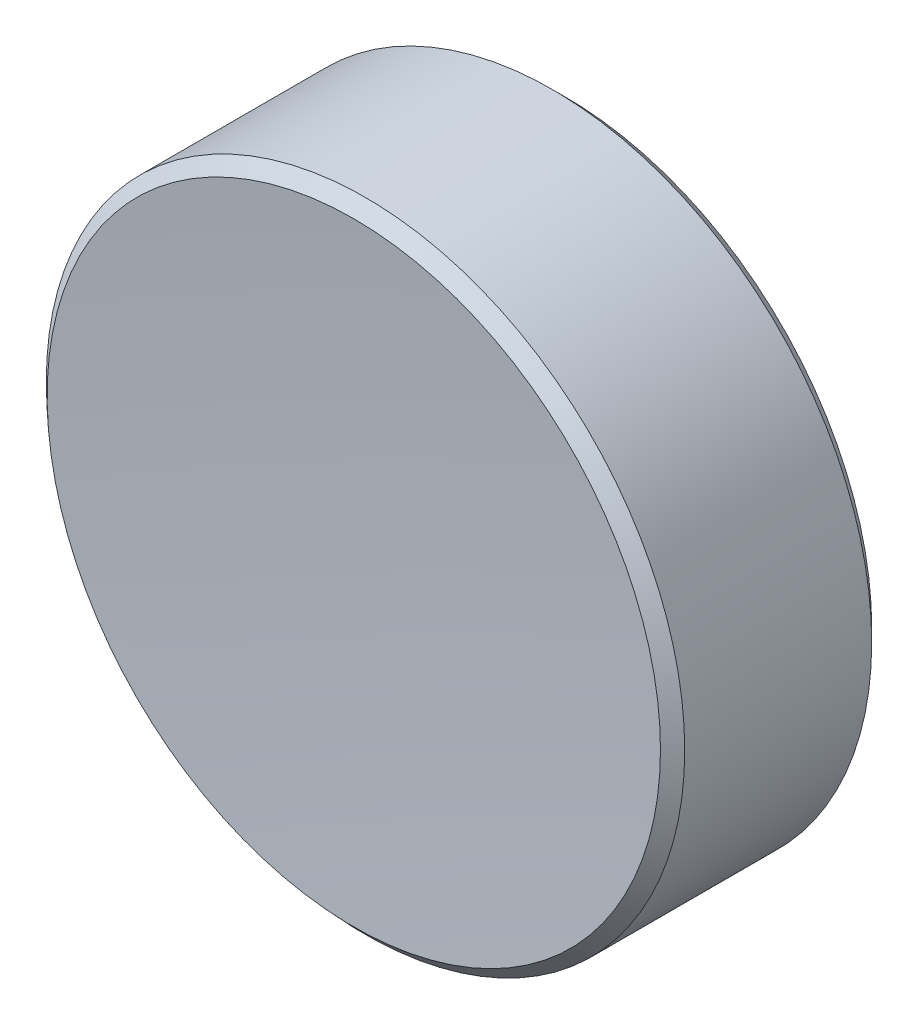
ISO-10303-21;
HEADER;
FILE_DESCRIPTION(('STEP AP214'),'2;1');
FILE_NAME('part.step','',(''),(''),'','','');
FILE_SCHEMA(('AUTOMOTIVE_DESIGN { 1 0 10303 214 1 1 1 1 }'));
ENDSEC;
DATA;
#1=APPLICATION_CONTEXT('core data for automotive mechanical design processes');
#2=APPLICATION_PROTOCOL_DEFINITION('international standard','automotive_design',2000,#1);
#3=PRODUCT_CONTEXT('',#1,'mechanical');
#4=PRODUCT('Part','Part','',(#3));
#5=PRODUCT_RELATED_PRODUCT_CATEGORY('part','',(#4));
#6=PRODUCT_DEFINITION_FORMATION('','',#4);
#7=PRODUCT_DEFINITION_CONTEXT('part definition',#1,'design');
#8=PRODUCT_DEFINITION('design','',#6,#7);
#9=PRODUCT_DEFINITION_SHAPE('','',#8);
#10=(LENGTH_UNIT() NAMED_UNIT(*) SI_UNIT(.MILLI.,.METRE.));
#11=(NAMED_UNIT(*) PLANE_ANGLE_UNIT() SI_UNIT($,.RADIAN.));
#12=(NAMED_UNIT(*) SI_UNIT($,.STERADIAN.) SOLID_ANGLE_UNIT());
#13=UNCERTAINTY_MEASURE_WITH_UNIT(LENGTH_MEASURE(1.E-05),#10,'distance_accuracy_value','');
#14=(GEOMETRIC_REPRESENTATION_CONTEXT(3) GLOBAL_UNCERTAINTY_ASSIGNED_CONTEXT((#13)) GLOBAL_UNIT_ASSIGNED_CONTEXT((#10,
#11,#12)) REPRESENTATION_CONTEXT('',''));
#15=CARTESIAN_POINT('',(0.,0.,0.));
#16=DIRECTION('',(0.,0.,1.));
#17=DIRECTION('',(1.,0.,0.));
#18=AXIS2_PLACEMENT_3D('',#15,#16,#17);
#19=CARTESIAN_POINT('',(0.,0.,93.8987659984779));
#20=DIRECTION('',(0.,0.,1.));
#21=DIRECTION('',(0.,1.,0.));
#22=AXIS2_PLACEMENT_3D('',#19,#20,#21);
#23=SPHERICAL_SURFACE('',#22,92.);
#24=CARTESIAN_POINT('',(0.,0.,2.10123400152212));
#25=DIRECTION('',(0.,0.,1.));
#26=DIRECTION('',(1.,0.,0.));
#27=AXIS2_PLACEMENT_3D('',#24,#25,#26);
#28=CIRCLE('',#27,6.10025567233687);
#29=CARTESIAN_POINT('',(6.10025567233687,0.,2.10123400152212));
#30=VERTEX_POINT('',#29);
#31=EDGE_CURVE('E9',#30,#30,#28,.T.);
#32=ORIENTED_EDGE('',*,*,#31,.T.);
#33=EDGE_LOOP('',(#32));
#34=FACE_BOUND('',#33,.T.);
#35=ADVANCED_FACE('F13',(#34),#23,.F.);
#36=CARTESIAN_POINT('',(0.,0.,1.89876599847788));
#37=DIRECTION('',(0.,0.,1.));
#38=DIRECTION('',(1.,0.,0.));
#39=AXIS2_PLACEMENT_3D('',#36,#37,#38);
#40=CYLINDRICAL_SURFACE('',#39,6.35);
#41=CARTESIAN_POINT('',(0.,0.,-1.85123400152212));
#42=DIRECTION('',(0.,0.,1.));
#43=DIRECTION('',(1.,0.,0.));
#44=AXIS2_PLACEMENT_3D('',#41,#42,#43);
#45=CIRCLE('',#44,6.35);
#46=CARTESIAN_POINT('',(6.35,0.,-1.85123400152212));
#47=VERTEX_POINT('',#46);
#48=EDGE_CURVE('E24',#47,#47,#45,.T.);
#49=ORIENTED_EDGE('',*,*,#48,.T.);
#50=EDGE_LOOP('',(#49));
#51=FACE_BOUND('',#50,.T.);
#52=CARTESIAN_POINT('',(0.,0.,1.86817164433349));
#53=DIRECTION('',(0.,0.,-1.));
#54=DIRECTION('',(-1.,0.,0.));
#55=AXIS2_PLACEMENT_3D('',#52,#53,#54);
#56=CIRCLE('',#55,6.35);
#57=CARTESIAN_POINT('',(-6.35,0.,1.86817164433349));
#58=VERTEX_POINT('',#57);
#59=EDGE_CURVE('E28',#58,#58,#56,.T.);
#60=ORIENTED_EDGE('',*,*,#59,.T.);
#61=EDGE_LOOP('',(#60));
#62=FACE_BOUND('',#61,.T.);
#63=ADVANCED_FACE('F34',(#51,#62),#40,.T.);
#64=CARTESIAN_POINT('',(0.,0.,-2.10123400152212));
#65=DIRECTION('',(0.,0.,1.));
#66=DIRECTION('',(1.,0.,0.));
#67=AXIS2_PLACEMENT_3D('',#64,#65,#66);
#68=PLANE('',#67);
#69=CARTESIAN_POINT('',(0.,0.,-2.10123400152212));
#70=DIRECTION('',(0.,0.,1.));
#71=DIRECTION('',(1.,0.,0.));
#72=AXIS2_PLACEMENT_3D('',#69,#70,#71);
#73=CIRCLE('',#72,6.1);
#74=CARTESIAN_POINT('',(6.1,0.,-2.10123400152212));
#75=VERTEX_POINT('',#74);
#76=EDGE_CURVE('E20',#75,#75,#73,.F.);
#77=ORIENTED_EDGE('',*,*,#76,.T.);
#78=EDGE_LOOP('',(#77));
#79=FACE_BOUND('',#78,.T.);
#80=ADVANCED_FACE('F43',(#79),#68,.F.);
#81=CARTESIAN_POINT('',(0.,0.,-1.85123400152212));
#82=DIRECTION('',(0.,0.,1.));
#83=DIRECTION('',(1.,0.,0.));
#84=AXIS2_PLACEMENT_3D('',#81,#82,#83);
#85=CONICAL_SURFACE('',#84,6.35,0.785398163397448);
#86=ORIENTED_EDGE('',*,*,#76,.F.);
#87=EDGE_LOOP('',(#86));
#88=FACE_BOUND('',#87,.T.);
#89=ORIENTED_EDGE('',*,*,#48,.F.);
#90=EDGE_LOOP('',(#89));
#91=FACE_BOUND('',#90,.T.);
#92=ADVANCED_FACE('F38',(#88,#91),#85,.T.);
#93=CARTESIAN_POINT('',(0.,0.,2.10123400152209));
#94=DIRECTION('',(0.,0.,-1.));
#95=DIRECTION('',(-1.,0.,0.));
#96=AXIS2_PLACEMENT_3D('',#93,#94,#95);
#97=CONICAL_SURFACE('',#96,6.10025567233687,0.819936493506543);
#98=ORIENTED_EDGE('',*,*,#59,.F.);
#99=EDGE_LOOP('',(#98));
#100=FACE_BOUND('',#99,.T.);
#101=ORIENTED_EDGE('',*,*,#31,.F.);
#102=EDGE_LOOP('',(#101));
#103=FACE_BOUND('',#102,.T.);
#104=ADVANCED_FACE('F15',(#100,#103),#97,.T.);
#105=CLOSED_SHELL('',(#35,#63,#80,#92,#104));
#106=MANIFOLD_SOLID_BREP('B1',#105);
#107=ADVANCED_BREP_SHAPE_REPRESENTATION('',(#18,#106),#14);
#108=SHAPE_DEFINITION_REPRESENTATION(#9,#107);
ENDSEC;
END-ISO-10303-21;
